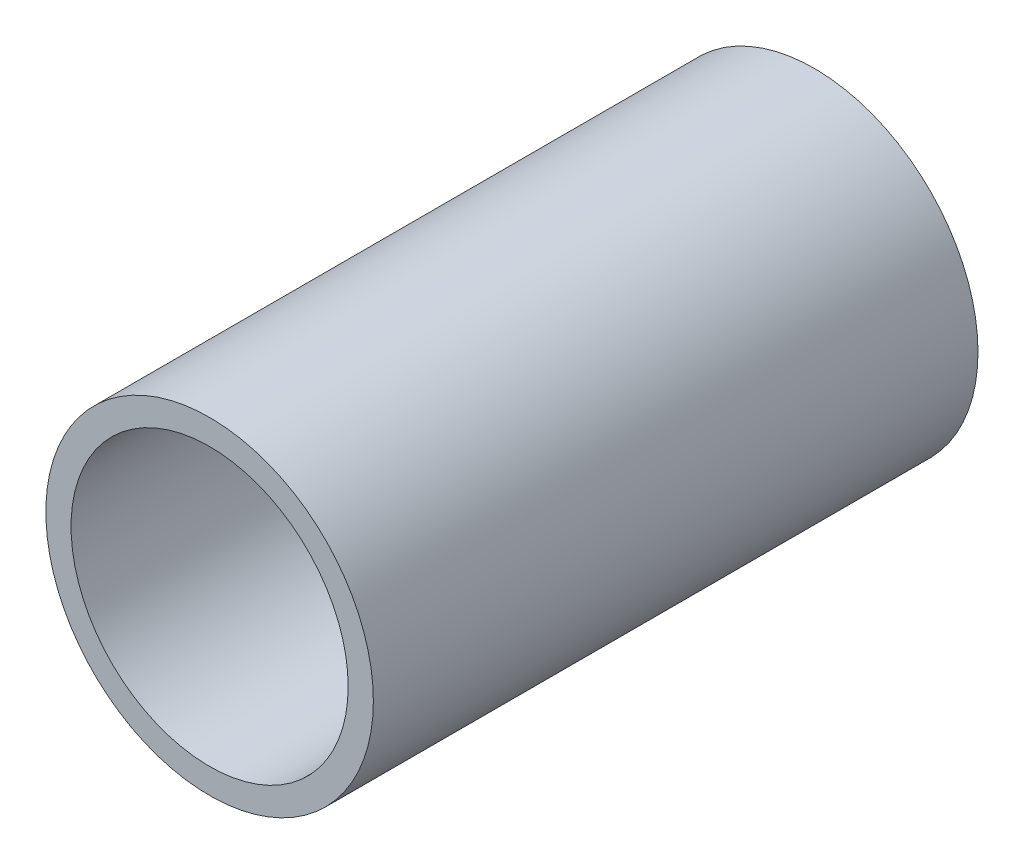
ISO-10303-21;
HEADER;
FILE_DESCRIPTION(('STEP AP214'),'2;1');
FILE_NAME('part.step','',(''),(''),'','','');
FILE_SCHEMA(('AUTOMOTIVE_DESIGN { 1 0 10303 214 1 1 1 1 }'));
ENDSEC;
DATA;
#1=APPLICATION_CONTEXT('core data for automotive mechanical design processes');
#2=APPLICATION_PROTOCOL_DEFINITION('international standard','automotive_design',2000,#1);
#3=PRODUCT_CONTEXT('',#1,'mechanical');
#4=PRODUCT('Part','Part','',(#3));
#5=PRODUCT_RELATED_PRODUCT_CATEGORY('part','',(#4));
#6=PRODUCT_DEFINITION_FORMATION('','',#4);
#7=PRODUCT_DEFINITION_CONTEXT('part definition',#1,'design');
#8=PRODUCT_DEFINITION('design','',#6,#7);
#9=PRODUCT_DEFINITION_SHAPE('','',#8);
#10=(LENGTH_UNIT() NAMED_UNIT(*) SI_UNIT(.MILLI.,.METRE.));
#11=(NAMED_UNIT(*) PLANE_ANGLE_UNIT() SI_UNIT($,.RADIAN.));
#12=(NAMED_UNIT(*) SI_UNIT($,.STERADIAN.) SOLID_ANGLE_UNIT());
#13=UNCERTAINTY_MEASURE_WITH_UNIT(LENGTH_MEASURE(1.E-05),#10,'distance_accuracy_value','');
#14=(GEOMETRIC_REPRESENTATION_CONTEXT(3) GLOBAL_UNCERTAINTY_ASSIGNED_CONTEXT((#13)) GLOBAL_UNIT_ASSIGNED_CONTEXT((#10,
#11,#12)) REPRESENTATION_CONTEXT('',''));
#15=CARTESIAN_POINT('',(0.,0.,0.));
#16=DIRECTION('',(0.,0.,1.));
#17=DIRECTION('',(1.,0.,0.));
#18=AXIS2_PLACEMENT_3D('',#15,#16,#17);
#19=CARTESIAN_POINT('',(0.,0.,12.));
#20=DIRECTION('',(0.,0.,-1.));
#21=DIRECTION('',(-1.,0.,0.));
#22=AXIS2_PLACEMENT_3D('',#19,#20,#21);
#23=CYLINDRICAL_SURFACE('',#22,3.25);
#24=CARTESIAN_POINT('',(0.,0.,12.));
#25=DIRECTION('',(0.,0.,1.));
#26=DIRECTION('',(1.,0.,0.));
#27=AXIS2_PLACEMENT_3D('',#24,#25,#26);
#28=CIRCLE('',#27,3.25);
#29=CARTESIAN_POINT('',(3.25,0.,12.));
#30=VERTEX_POINT('',#29);
#31=EDGE_CURVE('E10',#30,#30,#28,.T.);
#32=ORIENTED_EDGE('',*,*,#31,.F.);
#33=EDGE_LOOP('',(#32));
#34=FACE_BOUND('',#33,.T.);
#35=CARTESIAN_POINT('',(0.,0.,0.));
#36=DIRECTION('',(0.,0.,1.));
#37=DIRECTION('',(1.,0.,0.));
#38=AXIS2_PLACEMENT_3D('',#35,#36,#37);
#39=CIRCLE('',#38,3.25);
#40=CARTESIAN_POINT('',(3.25,0.,0.));
#41=VERTEX_POINT('',#40);
#42=EDGE_CURVE('E37',#41,#41,#39,.T.);
#43=ORIENTED_EDGE('',*,*,#42,.T.);
#44=EDGE_LOOP('',(#43));
#45=FACE_BOUND('',#44,.T.);
#46=ADVANCED_FACE('F34',(#34,#45),#23,.T.);
#47=CARTESIAN_POINT('',(0.,0.,12.));
#48=DIRECTION('',(0.,0.,1.));
#49=DIRECTION('',(1.,0.,0.));
#50=AXIS2_PLACEMENT_3D('',#47,#48,#49);
#51=PLANE('',#50);
#52=CARTESIAN_POINT('',(0.,0.,12.));
#53=DIRECTION('',(0.,0.,1.));
#54=DIRECTION('',(1.,0.,0.));
#55=AXIS2_PLACEMENT_3D('',#52,#53,#54);
#56=CIRCLE('',#55,2.75);
#57=CARTESIAN_POINT('',(2.75,0.,12.));
#58=VERTEX_POINT('',#57);
#59=EDGE_CURVE('E46',#58,#58,#56,.T.);
#60=ORIENTED_EDGE('',*,*,#59,.F.);
#61=EDGE_LOOP('',(#60));
#62=FACE_BOUND('',#61,.T.);
#63=ORIENTED_EDGE('',*,*,#31,.T.);
#64=EDGE_LOOP('',(#63));
#65=FACE_BOUND('',#64,.T.);
#66=ADVANCED_FACE('F61',(#62,#65),#51,.T.);
#67=CARTESIAN_POINT('',(0.,0.,0.));
#68=DIRECTION('',(0.,0.,1.));
#69=DIRECTION('',(1.,0.,0.));
#70=AXIS2_PLACEMENT_3D('',#67,#68,#69);
#71=PLANE('',#70);
#72=CARTESIAN_POINT('',(0.,0.,0.));
#73=DIRECTION('',(0.,0.,1.));
#74=DIRECTION('',(1.,0.,0.));
#75=AXIS2_PLACEMENT_3D('',#72,#73,#74);
#76=CIRCLE('',#75,2.75);
#77=CARTESIAN_POINT('',(2.75,0.,0.));
#78=VERTEX_POINT('',#77);
#79=EDGE_CURVE('E44',#78,#78,#76,.T.);
#80=ORIENTED_EDGE('',*,*,#79,.T.);
#81=EDGE_LOOP('',(#80));
#82=FACE_BOUND('',#81,.T.);
#83=ORIENTED_EDGE('',*,*,#42,.F.);
#84=EDGE_LOOP('',(#83));
#85=FACE_BOUND('',#84,.T.);
#86=ADVANCED_FACE('F52',(#82,#85),#71,.F.);
#87=CARTESIAN_POINT('',(0.,0.,0.));
#88=DIRECTION('',(0.,0.,1.));
#89=DIRECTION('',(1.,0.,0.));
#90=AXIS2_PLACEMENT_3D('',#87,#88,#89);
#91=CYLINDRICAL_SURFACE('',#90,2.75);
#92=ORIENTED_EDGE('',*,*,#79,.F.);
#93=EDGE_LOOP('',(#92));
#94=FACE_BOUND('',#93,.T.);
#95=ORIENTED_EDGE('',*,*,#59,.T.);
#96=EDGE_LOOP('',(#95));
#97=FACE_BOUND('',#96,.T.);
#98=ADVANCED_FACE('F55',(#94,#97),#91,.F.);
#99=CLOSED_SHELL('',(#46,#66,#86,#98));
#100=MANIFOLD_SOLID_BREP('B2',#99);
#101=ADVANCED_BREP_SHAPE_REPRESENTATION('',(#18,#100),#14);
#102=SHAPE_DEFINITION_REPRESENTATION(#9,#101);
ENDSEC;
END-ISO-10303-21;
